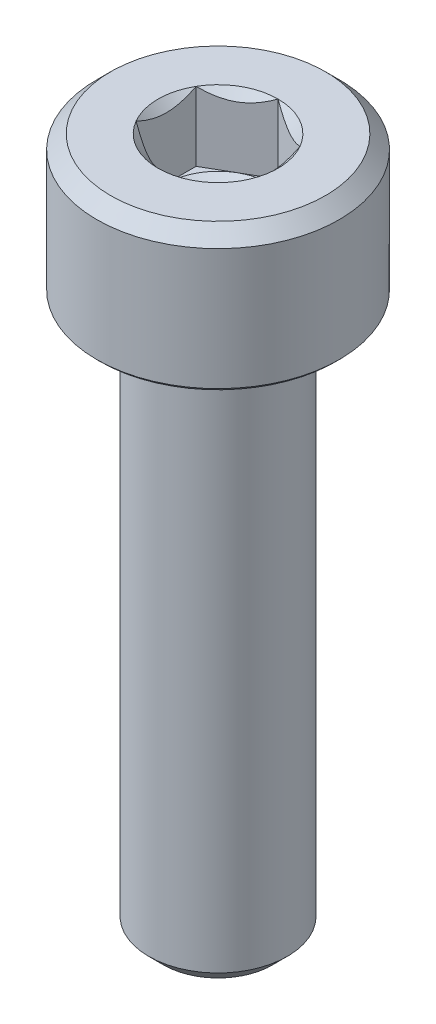
ISO-10303-21;
HEADER;
FILE_DESCRIPTION(('STEP AP214'),'2;1');
FILE_NAME('part.step','',(''),(''),'','','');
FILE_SCHEMA(('AUTOMOTIVE_DESIGN { 1 0 10303 214 1 1 1 1 }'));
ENDSEC;
DATA;
#1=APPLICATION_CONTEXT('core data for automotive mechanical design processes');
#2=APPLICATION_PROTOCOL_DEFINITION('international standard','automotive_design',2000,#1);
#3=PRODUCT_CONTEXT('',#1,'mechanical');
#4=PRODUCT('Part','Part','',(#3));
#5=PRODUCT_RELATED_PRODUCT_CATEGORY('part','',(#4));
#6=PRODUCT_DEFINITION_FORMATION('','',#4);
#7=PRODUCT_DEFINITION_CONTEXT('part definition',#1,'design');
#8=PRODUCT_DEFINITION('design','',#6,#7);
#9=PRODUCT_DEFINITION_SHAPE('','',#8);
#10=(LENGTH_UNIT() NAMED_UNIT(*) SI_UNIT(.MILLI.,.METRE.));
#11=(NAMED_UNIT(*) PLANE_ANGLE_UNIT() SI_UNIT($,.RADIAN.));
#12=(NAMED_UNIT(*) SI_UNIT($,.STERADIAN.) SOLID_ANGLE_UNIT());
#13=UNCERTAINTY_MEASURE_WITH_UNIT(LENGTH_MEASURE(1.E-05),#10,'distance_accuracy_value','');
#14=(GEOMETRIC_REPRESENTATION_CONTEXT(3) GLOBAL_UNCERTAINTY_ASSIGNED_CONTEXT((#13)) GLOBAL_UNIT_ASSIGNED_CONTEXT((#10,
#11,#12)) REPRESENTATION_CONTEXT('',''));
#15=CARTESIAN_POINT('',(0.,0.,0.));
#16=DIRECTION('',(0.,0.,1.));
#17=DIRECTION('',(1.,0.,0.));
#18=AXIS2_PLACEMENT_3D('',#15,#16,#17);
#19=CARTESIAN_POINT('',(0.,4.,0.));
#20=DIRECTION('',(0.,1.,0.));
#21=DIRECTION('',(0.,0.,1.));
#22=AXIS2_PLACEMENT_3D('',#19,#20,#21);
#23=CONICAL_SURFACE('',#22,1.7320508075689,0.785398163397445);
#24=CARTESIAN_POINT('',(0.,4.,0.));
#25=DIRECTION('',(0.,1.,0.));
#26=DIRECTION('',(0.,0.,1.));
#27=AXIS2_PLACEMENT_3D('',#24,#25,#26);
#28=CIRCLE('',#27,1.7320508075689);
#29=CARTESIAN_POINT('',(-1.5,4.,-0.86602540378444));
#30=VERTEX_POINT('',#29);
#31=CARTESIAN_POINT('',(-1.50000000000004,4.,0.866025403784418));
#32=VERTEX_POINT('',#31);
#33=EDGE_CURVE('E247',#30,#32,#28,.T.);
#34=ORIENTED_EDGE('',*,*,#33,.T.);
#35=CARTESIAN_POINT('',(-1.5,5.28153461244855,2.61375153443124));
#36=CARTESIAN_POINT('',(-1.5,5.21450107999365,2.5364332982352));
#37=CARTESIAN_POINT('',(-1.5,5.14785604118913,2.45877114539815));
#38=CARTESIAN_POINT('',(-1.5,5.01561998169386,2.30249235648222));
#39=CARTESIAN_POINT('',(-1.5,4.95002947759351,2.22387528384095));
#40=CARTESIAN_POINT('',(-1.5,4.81875075752572,2.06367101348095));
#41=CARTESIAN_POINT('',(-1.5,4.75309501871379,1.98205709733283));
#42=CARTESIAN_POINT('',(-1.5,4.62377798942187,1.81728959712203));
#43=CARTESIAN_POINT('',(-1.5,4.56011620311967,1.73413640413563));
#44=CARTESIAN_POINT('',(-1.5,4.43545880315624,1.56566898274558));
#45=CARTESIAN_POINT('',(-1.5,4.37446688062461,1.48035200503114));
#46=CARTESIAN_POINT('',(-1.5,4.2564063541614,1.30690812630129));
#47=CARTESIAN_POINT('',(-1.5,4.19934096782129,1.21877900543265));
#48=CARTESIAN_POINT('',(-1.5,4.09158252478268,1.03958624771226));
#49=CARTESIAN_POINT('',(-1.5,4.04084368773945,0.948550507483815));
#50=CARTESIAN_POINT('',(-1.5,3.94844987030331,0.761986921363865));
#51=CARTESIAN_POINT('',(-1.5,3.90677817713367,0.666467741575942));
#52=CARTESIAN_POINT('',(-1.5,3.8542922732506,0.518335423838084));
#53=CARTESIAN_POINT('',(-1.5,3.8383468879137,0.467548943160185));
#54=CARTESIAN_POINT('',(-1.5,3.81087313047549,0.364780075017314));
#55=CARTESIAN_POINT('',(-1.5,3.79934405336009,0.312797879840445));
#56=CARTESIAN_POINT('',(-1.5,3.78146895230353,0.208263726468522));
#57=CARTESIAN_POINT('',(-1.5,3.77509135834624,0.155717269701104));
#58=CARTESIAN_POINT('',(-1.5,3.76786859784852,0.0502421784891453));
#59=CARTESIAN_POINT('',(-1.5,3.76702284990756,-0.00268641520717832));
#60=CARTESIAN_POINT('',(-1.5,3.77093156253543,-0.108400938777915));
#61=CARTESIAN_POINT('',(-1.5,3.77569334257604,-0.161186591847997));
#62=CARTESIAN_POINT('',(-1.5,3.79046885854601,-0.266012188152723));
#63=CARTESIAN_POINT('',(-1.5,3.80048362880619,-0.318051982451445));
#64=CARTESIAN_POINT('',(-1.5,3.82519736738058,-0.421378040345766));
#65=CARTESIAN_POINT('',(-1.5,3.83992908122158,-0.472656332990276));
#66=CARTESIAN_POINT('',(-1.5,3.87328050565471,-0.573912573221064));
#67=CARTESIAN_POINT('',(-1.5,3.89190025941529,-0.623890506362677));
#68=CARTESIAN_POINT('',(-1.5,3.93684584267668,-0.733662552428345));
#69=CARTESIAN_POINT('',(-1.5,3.96396264080806,-0.793130071865139));
#70=CARTESIAN_POINT('',(-1.5,4.02181315098886,-0.910294163138359));
#71=CARTESIAN_POINT('',(-1.5,4.05254895263484,-0.967989687354049));
#72=CARTESIAN_POINT('',(-1.5,4.11682626837555,-1.08192590330593));
#73=CARTESIAN_POINT('',(-1.5,4.15037292738328,-1.13816366920393));
#74=CARTESIAN_POINT('',(-1.5,4.21959355392663,-1.24931997810833));
#75=CARTESIAN_POINT('',(-1.5,4.25526794513362,-1.30423825530527));
#76=CARTESIAN_POINT('',(-1.5,4.36511423645762,-1.46789283632466));
#77=CARTESIAN_POINT('',(-1.5,4.44177274150289,-1.57495566964923));
#78=CARTESIAN_POINT('',(-1.5,4.59911814527717,-1.78584148920914));
#79=CARTESIAN_POINT('',(-1.5,4.67980054314415,-1.88966789317006));
#80=CARTESIAN_POINT('',(-1.5,4.84659527703811,-2.09844803265251));
#81=CARTESIAN_POINT('',(-1.5,4.93279886899882,-2.20332862589446));
#82=CARTESIAN_POINT('',(-1.5,5.06315440470001,-2.35880243066718));
#83=CARTESIAN_POINT('',(-1.5,5.10654041452752,-2.4100430081702));
#84=CARTESIAN_POINT('',(-1.5,5.19373642702162,-2.51215761680078));
#85=CARTESIAN_POINT('',(-1.5,5.23754640718608,-2.56303166713437));
#86=CARTESIAN_POINT('',(-1.5,5.2815346124484,-2.61375153443136));
#87=B_SPLINE_CURVE_WITH_KNOTS('',3,(#35,#36,#37,#38,#39,#40,#41,#42,#43,#44,#45,#46,#47,#48,#49,
#50,#51,#52,#53,#54,#55,#56,#57,#58,#59,#60,#61,#62,#63,#64,#65,#66,#67,#68,#69,#70,#71,#72,#73,
#74,#75,#76,#77,#78,#79,#80,#81,#82,#83,#84,#85,#86),.UNSPECIFIED.,.F.,.F.,(4,2,2,2,2,2,2,2,2,2,
2,2,2,2,2,2,2,2,2,2,2,2,2,2,2,4),(0.,0.306999294556212,0.614144659678539,0.928357224148121,
1.24249102505777,1.55704622448395,1.8718561891122,2.18423656804922,2.49603618850473,
2.65556931703017,2.81507696725606,2.97359952250406,3.13210541666291,3.290818437129,
3.44956272044174,3.60943382831675,3.76930671131586,3.96521523790353,4.1612374410813,
4.35762662181826,4.55405503872929,4.94890209364074,5.34331699281754,5.7505583659593,
5.95198061901673,6.15339223963107),.UNSPECIFIED.);
#88=EDGE_CURVE('E134',#32,#30,#87,.T.);
#89=ORIENTED_EDGE('',*,*,#88,.T.);
#90=EDGE_LOOP('',(#34,#89));
#91=FACE_BOUND('',#90,.T.);
#92=ADVANCED_FACE('F42',(#91),#23,.F.);
#93=CARTESIAN_POINT('',(0.,4.,-1.7320508075689));
#94=VERTEX_POINT('',#93);
#95=EDGE_CURVE('E249',#94,#30,#28,.T.);
#96=ORIENTED_EDGE('',*,*,#95,.T.);
#97=CARTESIAN_POINT('',(-1.5002,4.00011548160005,-0.865909933730602));
#98=CARTESIAN_POINT('',(-1.44863220926293,3.97036547606731,-0.895682611594167));
#99=CARTESIAN_POINT('',(-1.3962020823348,3.94236248391029,-0.925953159489766));
#100=CARTESIAN_POINT('',(-1.28929096594441,3.89108923044012,-0.987678321317124));
#101=CARTESIAN_POINT('',(-1.23479980418535,3.86784750504436,-1.01913880822718));
#102=CARTESIAN_POINT('',(-1.12492091864276,3.8280337289922,-1.08257741237344));
#103=CARTESIAN_POINT('',(-1.06956119090481,3.81136158567088,-1.11453936608521));
#104=CARTESIAN_POINT('',(-0.957622742522867,3.78567445681809,-1.1791670593912));
#105=CARTESIAN_POINT('',(-0.90104744344701,3.77664029047885,-1.21183082354213));
#106=CARTESIAN_POINT('',(-0.803544610483581,3.76848908122684,-1.26812411040032));
#107=CARTESIAN_POINT('',(-0.762743091719556,3.7672822529892,-1.29168087824208));
#108=CARTESIAN_POINT('',(-0.681212030384165,3.76931405716225,-1.33875285845138));
#109=CARTESIAN_POINT('',(-0.640482505685394,3.77255367074829,-1.36226806050018));
#110=CARTESIAN_POINT('',(-0.559415597836609,3.78329198598195,-1.40907206156905));
#111=CARTESIAN_POINT('',(-0.519078615401738,3.79079465301872,-1.43236062923612));
#112=CARTESIAN_POINT('',(-0.439081663085996,3.80965161192827,-1.47854689118997));
#113=CARTESIAN_POINT('',(-0.399421991483819,3.82100755701857,-1.50144441326545));
#114=CARTESIAN_POINT('',(-0.297836865225538,3.85472164759266,-1.56009461325634));
#115=CARTESIAN_POINT('',(-0.236541446290329,3.87962184909335,-1.59548353987867));
#116=CARTESIAN_POINT('',(-0.146414371536698,3.92165665327157,-1.64751843074896));
#117=CARTESIAN_POINT('',(-0.116714860092291,3.93642515355909,-1.66466545167618));
#118=CARTESIAN_POINT('',(-0.0578620986162534,3.96731056594017,-1.69864410935693));
#119=CARTESIAN_POINT('',(-0.0287085957793651,3.98342683412171,-1.71547589206763));
#120=CARTESIAN_POINT('',(0.000199999999999694,4.00011548160007,-1.73216627762274));
#121=B_SPLINE_CURVE_WITH_KNOTS('',3,(#97,#98,#99,#100,#101,#102,#103,#104,#105,#106,#107,#108,
#109,#110,#111,#112,#113,#114,#115,#116,#117,#118,#119,#120),.UNSPECIFIED.,.F.,.F.,(4,2,2,2,2,2,
2,2,2,2,2,4),(0.,0.199829143693299,0.400822987382378,0.598623720538165,0.795926240188868,
0.937113067959859,1.0783310557719,1.21968061668219,1.36109089931052,1.58570969637565,
1.69770705470964,1.80965120737195),.UNSPECIFIED.);
#122=EDGE_CURVE('E209',#30,#94,#121,.T.);
#123=ORIENTED_EDGE('',*,*,#122,.T.);
#124=EDGE_LOOP('',(#96,#123));
#125=FACE_BOUND('',#124,.T.);
#126=ADVANCED_FACE('F293',(#125),#23,.F.);
#127=CARTESIAN_POINT('',(1.5,4.,-0.86602540378444));
#128=VERTEX_POINT('',#127);
#129=EDGE_CURVE('E246',#128,#94,#28,.T.);
#130=ORIENTED_EDGE('',*,*,#129,.T.);
#131=CARTESIAN_POINT('',(-0.0002,4.00011548160007,-1.73216627762274));
#132=CARTESIAN_POINT('',(0.0513677907370763,3.97036547606733,-1.70239359975917));
#133=CARTESIAN_POINT('',(0.103797917665202,3.94236248391031,-1.67212305186357));
#134=CARTESIAN_POINT('',(0.210709034055599,3.89108923044014,-1.61039789003621));
#135=CARTESIAN_POINT('',(0.265200195814664,3.86784750504437,-1.57893740312616));
#136=CARTESIAN_POINT('',(0.375079081357254,3.82803372899221,-1.51549879897989));
#137=CARTESIAN_POINT('',(0.430438809095206,3.81136158567089,-1.48353684526812));
#138=CARTESIAN_POINT('',(0.542377257477159,3.78567445681809,-1.41890915196212));
#139=CARTESIAN_POINT('',(0.598952556553018,3.77664029047885,-1.38624538781119));
#140=CARTESIAN_POINT('',(0.696455389516451,3.76848908122684,-1.329952100953));
#141=CARTESIAN_POINT('',(0.737256908280475,3.7672822529892,-1.30639533311125));
#142=CARTESIAN_POINT('',(0.818787969615867,3.76931405716225,-1.25932335290194));
#143=CARTESIAN_POINT('',(0.859517494314638,3.77255367074829,-1.23580815085314));
#144=CARTESIAN_POINT('',(0.940584402163423,3.78329198598195,-1.18900414978427));
#145=CARTESIAN_POINT('',(0.980921384598295,3.79079465301872,-1.1657155821172));
#146=CARTESIAN_POINT('',(1.06091833691404,3.80965161192827,-1.11952932016336));
#147=CARTESIAN_POINT('',(1.10057800851621,3.82100755701857,-1.09663179808787));
#148=CARTESIAN_POINT('',(1.20216313477449,3.85472164759265,-1.03798159809699));
#149=CARTESIAN_POINT('',(1.26345855370969,3.87962184909335,-1.00259267147466));
#150=CARTESIAN_POINT('',(1.35358562846331,3.92165665327156,-0.950557780604377));
#151=CARTESIAN_POINT('',(1.38328513990772,3.93642515355908,-0.93341075967715));
#152=CARTESIAN_POINT('',(1.44213790138375,3.96731056594015,-0.899432101996409));
#153=CARTESIAN_POINT('',(1.47129140422064,3.98342683412169,-0.882600319285712));
#154=CARTESIAN_POINT('',(1.5002,4.00011548160005,-0.865909933730602));
#155=B_SPLINE_CURVE_WITH_KNOTS('',3,(#131,#132,#133,#134,#135,#136,#137,#138,#139,#140,#141,
#142,#143,#144,#145,#146,#147,#148,#149,#150,#151,#152,#153,#154),.UNSPECIFIED.,.F.,.F.,(4,2,2,
2,2,2,2,2,2,2,2,4),(0.,0.19982914369331,0.400822987382399,0.598623720538196,0.795926240188909,
0.9371130679599,1.07833105577195,1.21968061668224,1.36109089931056,1.58570969637567,
1.69770705470965,1.80965120737195),.UNSPECIFIED.);
#156=EDGE_CURVE('E260',#94,#128,#155,.T.);
#157=ORIENTED_EDGE('',*,*,#156,.T.);
#158=EDGE_LOOP('',(#130,#157));
#159=FACE_BOUND('',#158,.T.);
#160=ADVANCED_FACE('F258',(#159),#23,.F.);
#161=CARTESIAN_POINT('',(1.5,4.,0.86602540378444));
#162=VERTEX_POINT('',#161);
#163=EDGE_CURVE('E241',#162,#128,#28,.T.);
#164=ORIENTED_EDGE('',*,*,#163,.T.);
#165=CARTESIAN_POINT('',(1.5,5.28153461244855,-2.61375153443124));
#166=CARTESIAN_POINT('',(1.5,5.21450107999365,-2.5364332982352));
#167=CARTESIAN_POINT('',(1.5,5.14785604118913,-2.45877114539815));
#168=CARTESIAN_POINT('',(1.5,5.01561998169386,-2.30249235648222));
#169=CARTESIAN_POINT('',(1.5,4.95002947759351,-2.22387528384095));
#170=CARTESIAN_POINT('',(1.5,4.81875075752572,-2.06367101348095));
#171=CARTESIAN_POINT('',(1.5,4.75309501871379,-1.98205709733283));
#172=CARTESIAN_POINT('',(1.5,4.62377798942187,-1.81728959712203));
#173=CARTESIAN_POINT('',(1.5,4.56011620311967,-1.73413640413563));
#174=CARTESIAN_POINT('',(1.5,4.43545880315624,-1.56566898274558));
#175=CARTESIAN_POINT('',(1.5,4.37446688062461,-1.48035200503114));
#176=CARTESIAN_POINT('',(1.5,4.2564063541614,-1.30690812630129));
#177=CARTESIAN_POINT('',(1.5,4.19934096782129,-1.21877900543265));
#178=CARTESIAN_POINT('',(1.5,4.09158252478268,-1.03958624771226));
#179=CARTESIAN_POINT('',(1.5,4.04084368773945,-0.948550507483815));
#180=CARTESIAN_POINT('',(1.5,3.94844987030331,-0.761986921363865));
#181=CARTESIAN_POINT('',(1.5,3.90677817713367,-0.666467741575942));
#182=CARTESIAN_POINT('',(1.5,3.8542922732506,-0.518335423838084));
#183=CARTESIAN_POINT('',(1.5,3.8383468879137,-0.467548943160185));
#184=CARTESIAN_POINT('',(1.5,3.81087313047549,-0.364780075017314));
#185=CARTESIAN_POINT('',(1.5,3.79934405336009,-0.312797879840445));
#186=CARTESIAN_POINT('',(1.5,3.78146895230353,-0.208263726468522));
#187=CARTESIAN_POINT('',(1.5,3.77509135834624,-0.155717269701104));
#188=CARTESIAN_POINT('',(1.5,3.76786859784852,-0.0502421784891453));
#189=CARTESIAN_POINT('',(1.5,3.76702284990756,0.00268641520717832));
#190=CARTESIAN_POINT('',(1.5,3.77093156253543,0.108400938777915));
#191=CARTESIAN_POINT('',(1.5,3.77569334257604,0.161186591847997));
#192=CARTESIAN_POINT('',(1.5,3.79046885854601,0.266012188152723));
#193=CARTESIAN_POINT('',(1.5,3.80048362880619,0.318051982451445));
#194=CARTESIAN_POINT('',(1.5,3.82519736738058,0.421378040345766));
#195=CARTESIAN_POINT('',(1.5,3.83992908122158,0.472656332990276));
#196=CARTESIAN_POINT('',(1.5,3.87328050565471,0.573912573221064));
#197=CARTESIAN_POINT('',(1.5,3.89190025941529,0.623890506362677));
#198=CARTESIAN_POINT('',(1.5,3.93684584267668,0.733662552428345));
#199=CARTESIAN_POINT('',(1.5,3.96396264080806,0.793130071865139));
#200=CARTESIAN_POINT('',(1.5,4.02181315098886,0.910294163138359));
#201=CARTESIAN_POINT('',(1.5,4.05254895263484,0.967989687354049));
#202=CARTESIAN_POINT('',(1.5,4.11682626837555,1.08192590330593));
#203=CARTESIAN_POINT('',(1.5,4.15037292738328,1.13816366920393));
#204=CARTESIAN_POINT('',(1.5,4.21959355392663,1.24931997810833));
#205=CARTESIAN_POINT('',(1.5,4.25526794513362,1.30423825530527));
#206=CARTESIAN_POINT('',(1.5,4.36511423645762,1.46789283632466));
#207=CARTESIAN_POINT('',(1.5,4.44177274150289,1.57495566964923));
#208=CARTESIAN_POINT('',(1.5,4.59911814527717,1.78584148920914));
#209=CARTESIAN_POINT('',(1.5,4.67980054314415,1.88966789317006));
#210=CARTESIAN_POINT('',(1.5,4.84659527703811,2.09844803265251));
#211=CARTESIAN_POINT('',(1.5,4.93279886899882,2.20332862589446));
#212=CARTESIAN_POINT('',(1.5,5.06315440470001,2.35880243066718));
#213=CARTESIAN_POINT('',(1.5,5.10654041452752,2.4100430081702));
#214=CARTESIAN_POINT('',(1.5,5.19373642702162,2.51215761680078));
#215=CARTESIAN_POINT('',(1.5,5.23754640718608,2.56303166713437));
#216=CARTESIAN_POINT('',(1.5,5.2815346124484,2.61375153443136));
#217=B_SPLINE_CURVE_WITH_KNOTS('',3,(#165,#166,#167,#168,#169,#170,#171,#172,#173,#174,#175,
#176,#177,#178,#179,#180,#181,#182,#183,#184,#185,#186,#187,#188,#189,#190,#191,#192,#193,#194,
#195,#196,#197,#198,#199,#200,#201,#202,#203,#204,#205,#206,#207,#208,#209,#210,#211,#212,#213,
#214,#215,#216),.UNSPECIFIED.,.F.,.F.,(4,2,2,2,2,2,2,2,2,2,2,2,2,2,2,2,2,2,2,2,2,2,2,2,2,4),(0.,
0.306999294556212,0.614144659678539,0.928357224148121,1.24249102505777,1.55704622448395,
1.8718561891122,2.18423656804922,2.49603618850473,2.65556931703017,2.81507696725606,
2.97359952250406,3.13210541666291,3.290818437129,3.44956272044174,3.60943382831675,
3.76930671131586,3.96521523790353,4.1612374410813,4.35762662181826,4.55405503872929,
4.94890209364074,5.34331699281754,5.7505583659593,5.95198061901673,6.15339223963107),.UNSPECIFIED.);
#218=EDGE_CURVE('E268',#128,#162,#217,.T.);
#219=ORIENTED_EDGE('',*,*,#218,.T.);
#220=EDGE_LOOP('',(#164,#219));
#221=FACE_BOUND('',#220,.T.);
#222=ADVANCED_FACE('F267',(#221),#23,.F.);
#223=CARTESIAN_POINT('',(0.,4.,1.7320508075689));
#224=VERTEX_POINT('',#223);
#225=EDGE_CURVE('E239',#224,#162,#28,.T.);
#226=ORIENTED_EDGE('',*,*,#225,.T.);
#227=CARTESIAN_POINT('',(1.5002,4.00011548160005,0.865909933730602));
#228=CARTESIAN_POINT('',(1.44863220926293,3.97036547606731,0.895682611594167));
#229=CARTESIAN_POINT('',(1.3962020823348,3.94236248391029,0.925953159489766));
#230=CARTESIAN_POINT('',(1.28929096594441,3.89108923044012,0.987678321317124));
#231=CARTESIAN_POINT('',(1.23479980418535,3.86784750504436,1.01913880822718));
#232=CARTESIAN_POINT('',(1.12492091864276,3.8280337289922,1.08257741237344));
#233=CARTESIAN_POINT('',(1.06956119090481,3.81136158567088,1.11453936608521));
#234=CARTESIAN_POINT('',(0.957622742522867,3.78567445681809,1.1791670593912));
#235=CARTESIAN_POINT('',(0.90104744344701,3.77664029047885,1.21183082354213));
#236=CARTESIAN_POINT('',(0.803544610483581,3.76848908122684,1.26812411040032));
#237=CARTESIAN_POINT('',(0.762743091719556,3.7672822529892,1.29168087824208));
#238=CARTESIAN_POINT('',(0.681212030384165,3.76931405716225,1.33875285845138));
#239=CARTESIAN_POINT('',(0.640482505685394,3.77255367074829,1.36226806050018));
#240=CARTESIAN_POINT('',(0.559415597836609,3.78329198598195,1.40907206156905));
#241=CARTESIAN_POINT('',(0.519078615401738,3.79079465301872,1.43236062923612));
#242=CARTESIAN_POINT('',(0.439081663085996,3.80965161192827,1.47854689118997));
#243=CARTESIAN_POINT('',(0.399421991483819,3.82100755701857,1.50144441326545));
#244=CARTESIAN_POINT('',(0.297836865225538,3.85472164759266,1.56009461325634));
#245=CARTESIAN_POINT('',(0.236541446290329,3.87962184909335,1.59548353987867));
#246=CARTESIAN_POINT('',(0.146414371536698,3.92165665327157,1.64751843074896));
#247=CARTESIAN_POINT('',(0.116714860092291,3.93642515355909,1.66466545167618));
#248=CARTESIAN_POINT('',(0.0578620986162534,3.96731056594017,1.69864410935693));
#249=CARTESIAN_POINT('',(0.0287085957793651,3.98342683412171,1.71547589206763));
#250=CARTESIAN_POINT('',(-0.000199999999999694,4.00011548160007,1.73216627762274));
#251=B_SPLINE_CURVE_WITH_KNOTS('',3,(#227,#228,#229,#230,#231,#232,#233,#234,#235,#236,#237,
#238,#239,#240,#241,#242,#243,#244,#245,#246,#247,#248,#249,#250),.UNSPECIFIED.,.F.,.F.,(4,2,2,
2,2,2,2,2,2,2,2,4),(0.,0.199829143693299,0.400822987382378,0.598623720538165,0.795926240188868,
0.937113067959859,1.0783310557719,1.21968061668219,1.36109089931052,1.58570969637565,
1.69770705470964,1.80965120737195),.UNSPECIFIED.);
#252=EDGE_CURVE('E178',#162,#224,#251,.T.);
#253=ORIENTED_EDGE('',*,*,#252,.T.);
#254=EDGE_LOOP('',(#226,#253));
#255=FACE_BOUND('',#254,.T.);
#256=ADVANCED_FACE('F298',(#255),#23,.F.);
#257=EDGE_CURVE('E238',#32,#224,#28,.T.);
#258=ORIENTED_EDGE('',*,*,#257,.T.);
#259=CARTESIAN_POINT('',(0.0002,4.00011548160007,1.73216627762274));
#260=CARTESIAN_POINT('',(-0.0513677907370763,3.97036547606733,1.70239359975917));
#261=CARTESIAN_POINT('',(-0.103797917665202,3.94236248391031,1.67212305186357));
#262=CARTESIAN_POINT('',(-0.210709034055599,3.89108923044014,1.61039789003621));
#263=CARTESIAN_POINT('',(-0.265200195814664,3.86784750504437,1.57893740312616));
#264=CARTESIAN_POINT('',(-0.375079081357254,3.82803372899221,1.51549879897989));
#265=CARTESIAN_POINT('',(-0.430438809095206,3.81136158567089,1.48353684526812));
#266=CARTESIAN_POINT('',(-0.542377257477159,3.78567445681809,1.41890915196212));
#267=CARTESIAN_POINT('',(-0.598952556553018,3.77664029047885,1.38624538781119));
#268=CARTESIAN_POINT('',(-0.696455389516451,3.76848908122684,1.329952100953));
#269=CARTESIAN_POINT('',(-0.737256908280475,3.7672822529892,1.30639533311125));
#270=CARTESIAN_POINT('',(-0.818787969615867,3.76931405716225,1.25932335290194));
#271=CARTESIAN_POINT('',(-0.859517494314638,3.77255367074829,1.23580815085314));
#272=CARTESIAN_POINT('',(-0.940584402163423,3.78329198598195,1.18900414978427));
#273=CARTESIAN_POINT('',(-0.980921384598295,3.79079465301872,1.1657155821172));
#274=CARTESIAN_POINT('',(-1.06091833691404,3.80965161192827,1.11952932016336));
#275=CARTESIAN_POINT('',(-1.10057800851621,3.82100755701857,1.09663179808787));
#276=CARTESIAN_POINT('',(-1.20216313477449,3.85472164759265,1.03798159809699));
#277=CARTESIAN_POINT('',(-1.26345855370969,3.87962184909335,1.00259267147466));
#278=CARTESIAN_POINT('',(-1.35358562846331,3.92165665327156,0.950557780604377));
#279=CARTESIAN_POINT('',(-1.38328513990772,3.93642515355908,0.93341075967715));
#280=CARTESIAN_POINT('',(-1.44213790138375,3.96731056594015,0.899432101996409));
#281=CARTESIAN_POINT('',(-1.47129140422064,3.98342683412169,0.882600319285712));
#282=CARTESIAN_POINT('',(-1.5002,4.00011548160005,0.865909933730602));
#283=B_SPLINE_CURVE_WITH_KNOTS('',3,(#259,#260,#261,#262,#263,#264,#265,#266,#267,#268,#269,
#270,#271,#272,#273,#274,#275,#276,#277,#278,#279,#280,#281,#282),.UNSPECIFIED.,.F.,.F.,(4,2,2,
2,2,2,2,2,2,2,2,4),(0.,0.19982914369331,0.400822987382399,0.598623720538196,0.795926240188909,
0.9371130679599,1.07833105577195,1.21968061668224,1.36109089931056,1.58570969637567,
1.69770705470965,1.80965120737195),.UNSPECIFIED.);
#284=EDGE_CURVE('E65',#224,#32,#283,.T.);
#285=ORIENTED_EDGE('',*,*,#284,.T.);
#286=EDGE_LOOP('',(#258,#285));
#287=FACE_BOUND('',#286,.T.);
#288=ADVANCED_FACE('F185',(#287),#23,.F.);
#289=CARTESIAN_POINT('',(1.7320508075689,4.,0.));
#290=DIRECTION('',(0.,-1.,0.));
#291=DIRECTION('',(0.,0.,-1.));
#292=AXIS2_PLACEMENT_3D('',#289,#290,#291);
#293=PLANE('',#292);
#294=ORIENTED_EDGE('',*,*,#225,.F.);
#295=ORIENTED_EDGE('',*,*,#257,.F.);
#296=ORIENTED_EDGE('',*,*,#33,.F.);
#297=ORIENTED_EDGE('',*,*,#95,.F.);
#298=ORIENTED_EDGE('',*,*,#129,.F.);
#299=ORIENTED_EDGE('',*,*,#163,.F.);
#300=EDGE_LOOP('',(#294,#295,#296,#297,#298,#299));
#301=FACE_BOUND('',#300,.T.);
#302=CARTESIAN_POINT('',(0.,4.,0.));
#303=DIRECTION('',(0.,1.,0.));
#304=DIRECTION('',(0.,0.,1.));
#305=AXIS2_PLACEMENT_3D('',#302,#303,#304);
#306=CIRCLE('',#305,3.1);
#307=CARTESIAN_POINT('',(0.,4.,3.1));
#308=VERTEX_POINT('',#307);
#309=EDGE_CURVE('E236',#308,#308,#306,.T.);
#310=ORIENTED_EDGE('',*,*,#309,.T.);
#311=EDGE_LOOP('',(#310));
#312=FACE_BOUND('',#311,.T.);
#313=ADVANCED_FACE('F264',(#301,#312),#293,.F.);
#314=CARTESIAN_POINT('',(0.,3.6,0.));
#315=DIRECTION('',(0.,-1.,0.));
#316=DIRECTION('',(0.,0.,-1.));
#317=AXIS2_PLACEMENT_3D('',#314,#315,#316);
#318=CONICAL_SURFACE('',#317,3.5,0.785398163397447);
#319=ORIENTED_EDGE('',*,*,#309,.F.);
#320=EDGE_LOOP('',(#319));
#321=FACE_BOUND('',#320,.T.);
#322=CARTESIAN_POINT('',(0.,3.6,0.));
#323=DIRECTION('',(0.,1.,0.));
#324=DIRECTION('',(0.,0.,1.));
#325=AXIS2_PLACEMENT_3D('',#322,#323,#324);
#326=CIRCLE('',#325,3.5);
#327=CARTESIAN_POINT('',(0.,3.6,3.5));
#328=VERTEX_POINT('',#327);
#329=EDGE_CURVE('E233',#328,#328,#326,.T.);
#330=ORIENTED_EDGE('',*,*,#329,.T.);
#331=EDGE_LOOP('',(#330));
#332=FACE_BOUND('',#331,.T.);
#333=ADVANCED_FACE('F303',(#321,#332),#318,.T.);
#334=CARTESIAN_POINT('',(0.,-16.,0.));
#335=DIRECTION('',(0.,1.,0.));
#336=DIRECTION('',(0.,0.,1.));
#337=AXIS2_PLACEMENT_3D('',#334,#335,#336);
#338=CYLINDRICAL_SURFACE('',#337,3.5);
#339=ORIENTED_EDGE('',*,*,#329,.F.);
#340=EDGE_LOOP('',(#339));
#341=FACE_BOUND('',#340,.T.);
#342=CARTESIAN_POINT('',(0.,0.0999999999999994,0.));
#343=DIRECTION('',(0.,1.,0.));
#344=DIRECTION('',(0.,0.,1.));
#345=AXIS2_PLACEMENT_3D('',#342,#343,#344);
#346=CIRCLE('',#345,3.5);
#347=CARTESIAN_POINT('',(0.,0.0999999999999994,3.5));
#348=VERTEX_POINT('',#347);
#349=EDGE_CURVE('E230',#348,#348,#346,.T.);
#350=ORIENTED_EDGE('',*,*,#349,.T.);
#351=EDGE_LOOP('',(#350));
#352=FACE_BOUND('',#351,.T.);
#353=ADVANCED_FACE('F381',(#341,#352),#338,.T.);
#354=CARTESIAN_POINT('',(0.,0.,0.));
#355=DIRECTION('',(0.,1.,0.));
#356=DIRECTION('',(0.,0.,1.));
#357=AXIS2_PLACEMENT_3D('',#354,#355,#356);
#358=CONICAL_SURFACE('',#357,3.4,0.785398163397453);
#359=ORIENTED_EDGE('',*,*,#349,.F.);
#360=EDGE_LOOP('',(#359));
#361=FACE_BOUND('',#360,.T.);
#362=CARTESIAN_POINT('',(0.,0.,0.));
#363=DIRECTION('',(0.,1.,0.));
#364=DIRECTION('',(0.,0.,1.));
#365=AXIS2_PLACEMENT_3D('',#362,#363,#364);
#366=CIRCLE('',#365,3.4);
#367=CARTESIAN_POINT('',(0.,0.,3.4));
#368=VERTEX_POINT('',#367);
#369=EDGE_CURVE('E227',#368,#368,#366,.T.);
#370=ORIENTED_EDGE('',*,*,#369,.T.);
#371=EDGE_LOOP('',(#370));
#372=FACE_BOUND('',#371,.T.);
#373=ADVANCED_FACE('F385',(#361,#372),#358,.T.);
#374=CARTESIAN_POINT('',(3.4,0.,0.));
#375=DIRECTION('',(0.,1.,0.));
#376=DIRECTION('',(0.,0.,1.));
#377=AXIS2_PLACEMENT_3D('',#374,#375,#376);
#378=PLANE('',#377);
#379=ORIENTED_EDGE('',*,*,#369,.F.);
#380=EDGE_LOOP('',(#379));
#381=FACE_BOUND('',#380,.T.);
#382=CARTESIAN_POINT('',(0.,0.,0.));
#383=DIRECTION('',(0.,1.,0.));
#384=DIRECTION('',(0.,0.,1.));
#385=AXIS2_PLACEMENT_3D('',#382,#383,#384);
#386=CIRCLE('',#385,2.05);
#387=CARTESIAN_POINT('',(0.,0.,2.05));
#388=VERTEX_POINT('',#387);
#389=EDGE_CURVE('E224',#388,#388,#386,.T.);
#390=ORIENTED_EDGE('',*,*,#389,.T.);
#391=EDGE_LOOP('',(#390));
#392=FACE_BOUND('',#391,.T.);
#393=ADVANCED_FACE('F442',(#381,#392),#378,.F.);
#394=CARTESIAN_POINT('',(0.,-0.6,0.));
#395=DIRECTION('',(0.,1.,0.));
#396=DIRECTION('',(0.,0.,1.));
#397=AXIS2_PLACEMENT_3D('',#394,#395,#396);
#398=CONICAL_SURFACE('',#397,2.,0.0831412318884407);
#399=ORIENTED_EDGE('',*,*,#389,.F.);
#400=EDGE_LOOP('',(#399));
#401=FACE_BOUND('',#400,.T.);
#402=CARTESIAN_POINT('',(0.,-0.6,0.));
#403=DIRECTION('',(0.,1.,0.));
#404=DIRECTION('',(0.,0.,1.));
#405=AXIS2_PLACEMENT_3D('',#402,#403,#404);
#406=CIRCLE('',#405,2.);
#407=CARTESIAN_POINT('',(0.,-0.6,2.));
#408=VERTEX_POINT('',#407);
#409=EDGE_CURVE('E221',#408,#408,#406,.T.);
#410=ORIENTED_EDGE('',*,*,#409,.T.);
#411=EDGE_LOOP('',(#410));
#412=FACE_BOUND('',#411,.T.);
#413=ADVANCED_FACE('F431',(#401,#412),#398,.T.);
#414=CARTESIAN_POINT('',(0.,-16.,0.));
#415=DIRECTION('',(0.,1.,0.));
#416=DIRECTION('',(0.,0.,1.));
#417=AXIS2_PLACEMENT_3D('',#414,#415,#416);
#418=CYLINDRICAL_SURFACE('',#417,2.);
#419=ORIENTED_EDGE('',*,*,#409,.F.);
#420=EDGE_LOOP('',(#419));
#421=FACE_BOUND('',#420,.T.);
#422=CARTESIAN_POINT('',(0.,-15.5705,0.));
#423=DIRECTION('',(0.,1.,0.));
#424=DIRECTION('',(0.,0.,1.));
#425=AXIS2_PLACEMENT_3D('',#422,#423,#424);
#426=CIRCLE('',#425,2.);
#427=CARTESIAN_POINT('',(0.,-15.5705,2.));
#428=VERTEX_POINT('',#427);
#429=EDGE_CURVE('E218',#428,#428,#426,.T.);
#430=ORIENTED_EDGE('',*,*,#429,.T.);
#431=EDGE_LOOP('',(#430));
#432=FACE_BOUND('',#431,.T.);
#433=ADVANCED_FACE('F324',(#421,#432),#418,.T.);
#434=CARTESIAN_POINT('',(0.,-16.,0.));
#435=DIRECTION('',(0.,1.,0.));
#436=DIRECTION('',(0.,0.,1.));
#437=AXIS2_PLACEMENT_3D('',#434,#435,#436);
#438=CONICAL_SURFACE('',#437,1.5705,0.785398163397447);
#439=ORIENTED_EDGE('',*,*,#429,.F.);
#440=EDGE_LOOP('',(#439));
#441=FACE_BOUND('',#440,.T.);
#442=CARTESIAN_POINT('',(0.,-16.,0.));
#443=DIRECTION('',(0.,1.,0.));
#444=DIRECTION('',(0.,0.,1.));
#445=AXIS2_PLACEMENT_3D('',#442,#443,#444);
#446=CIRCLE('',#445,1.5705);
#447=CARTESIAN_POINT('',(0.,-16.,1.5705));
#448=VERTEX_POINT('',#447);
#449=EDGE_CURVE('E208',#448,#448,#446,.T.);
#450=ORIENTED_EDGE('',*,*,#449,.T.);
#451=EDGE_LOOP('',(#450));
#452=FACE_BOUND('',#451,.T.);
#453=ADVANCED_FACE('F407',(#441,#452),#438,.T.);
#454=CARTESIAN_POINT('',(1.5705,-16.,0.));
#455=DIRECTION('',(0.,1.,0.));
#456=DIRECTION('',(0.,0.,1.));
#457=AXIS2_PLACEMENT_3D('',#454,#455,#456);
#458=PLANE('',#457);
#459=ORIENTED_EDGE('',*,*,#449,.F.);
#460=EDGE_LOOP('',(#459));
#461=FACE_BOUND('',#460,.T.);
#462=ADVANCED_FACE('F199',(#461),#458,.F.);
#463=CARTESIAN_POINT('',(0.,2.,0.));
#464=DIRECTION('',(0.,1.,0.));
#465=DIRECTION('',(0.,0.,1.));
#466=AXIS2_PLACEMENT_3D('',#463,#464,#465);
#467=PLANE('',#466);
#468=CARTESIAN_POINT('',(0.,2.,0.));
#469=DIRECTION('',(0.,1.,0.));
#470=DIRECTION('',(0.,0.,1.));
#471=AXIS2_PLACEMENT_3D('',#468,#469,#470);
#472=CIRCLE('',#471,1.5);
#473=CARTESIAN_POINT('',(-1.5,2.,0.));
#474=VERTEX_POINT('',#473);
#475=CARTESIAN_POINT('',(-0.750000000000019,2.,1.29903810567666));
#476=VERTEX_POINT('',#475);
#477=EDGE_CURVE('E124',#474,#476,#472,.T.);
#478=ORIENTED_EDGE('',*,*,#477,.F.);
#479=DIRECTION('',(0.,0.,1.));
#480=VECTOR('',#479,1.);
#481=CARTESIAN_POINT('',(-1.5,2.,-0.86602540378444));
#482=LINE('',#481,#480);
#483=CARTESIAN_POINT('',(-1.5,2.,0.86602540378444));
#484=VERTEX_POINT('',#483);
#485=EDGE_CURVE('E118',#474,#484,#482,.T.);
#486=ORIENTED_EDGE('',*,*,#485,.T.);
#487=DIRECTION('',(0.866025403784433,0.,0.500000000000009));
#488=VECTOR('',#487,1.);
#489=CARTESIAN_POINT('',(-1.5,2.,0.86602540378444));
#490=LINE('',#489,#488);
#491=EDGE_CURVE('E122',#484,#476,#490,.T.);
#492=ORIENTED_EDGE('',*,*,#491,.T.);
#493=EDGE_LOOP('',(#478,#486,#492));
#494=FACE_BOUND('',#493,.T.);
#495=ADVANCED_FACE('F120',(#494),#467,.T.);
#496=CARTESIAN_POINT('',(-0.750000000000019,2.,-1.29903810567666));
#497=VERTEX_POINT('',#496);
#498=EDGE_CURVE('E532',#497,#474,#472,.T.);
#499=ORIENTED_EDGE('',*,*,#498,.F.);
#500=DIRECTION('',(-0.866025403784433,0.,0.500000000000009));
#501=VECTOR('',#500,1.);
#502=CARTESIAN_POINT('',(0.,2.,-1.7320508075689));
#503=LINE('',#502,#501);
#504=CARTESIAN_POINT('',(-1.5,2.,-0.86602540378444));
#505=VERTEX_POINT('',#504);
#506=EDGE_CURVE('E156',#497,#505,#503,.T.);
#507=ORIENTED_EDGE('',*,*,#506,.T.);
#508=EDGE_CURVE('E128',#505,#474,#482,.T.);
#509=ORIENTED_EDGE('',*,*,#508,.T.);
#510=EDGE_LOOP('',(#499,#507,#509));
#511=FACE_BOUND('',#510,.T.);
#512=ADVANCED_FACE('F291',(#511),#467,.T.);
#513=CARTESIAN_POINT('',(0.750000000000019,2.,-1.29903810567666));
#514=VERTEX_POINT('',#513);
#515=EDGE_CURVE('E531',#514,#497,#472,.T.);
#516=ORIENTED_EDGE('',*,*,#515,.F.);
#517=DIRECTION('',(-0.866025403784433,0.,-0.500000000000009));
#518=VECTOR('',#517,1.);
#519=CARTESIAN_POINT('',(1.5,2.,-0.86602540378444));
#520=LINE('',#519,#518);
#521=CARTESIAN_POINT('',(0.,2.,-1.7320508075689));
#522=VERTEX_POINT('',#521);
#523=EDGE_CURVE('E152',#514,#522,#520,.T.);
#524=ORIENTED_EDGE('',*,*,#523,.T.);
#525=EDGE_CURVE('E138',#522,#497,#503,.T.);
#526=ORIENTED_EDGE('',*,*,#525,.T.);
#527=EDGE_LOOP('',(#516,#524,#526));
#528=FACE_BOUND('',#527,.T.);
#529=ADVANCED_FACE('F476',(#528),#467,.T.);
#530=CARTESIAN_POINT('',(1.5,2.,0.));
#531=VERTEX_POINT('',#530);
#532=EDGE_CURVE('E50',#531,#514,#472,.T.);
#533=ORIENTED_EDGE('',*,*,#532,.F.);
#534=DIRECTION('',(0.,0.,-1.));
#535=VECTOR('',#534,1.);
#536=CARTESIAN_POINT('',(1.5,2.,0.86602540378444));
#537=LINE('',#536,#535);
#538=CARTESIAN_POINT('',(1.5,2.,-0.86602540378444));
#539=VERTEX_POINT('',#538);
#540=EDGE_CURVE('E148',#531,#539,#537,.T.);
#541=ORIENTED_EDGE('',*,*,#540,.T.);
#542=EDGE_CURVE('E153',#539,#514,#520,.T.);
#543=ORIENTED_EDGE('',*,*,#542,.T.);
#544=EDGE_LOOP('',(#533,#541,#543));
#545=FACE_BOUND('',#544,.T.);
#546=ADVANCED_FACE('F289',(#545),#467,.T.);
#547=CARTESIAN_POINT('',(0.750000000000014,2.,1.29903810567665));
#548=VERTEX_POINT('',#547);
#549=EDGE_CURVE('E11',#548,#531,#472,.T.);
#550=ORIENTED_EDGE('',*,*,#549,.F.);
#551=DIRECTION('',(0.866025403784433,0.,-0.500000000000009));
#552=VECTOR('',#551,1.);
#553=CARTESIAN_POINT('',(0.,2.,1.7320508075689));
#554=LINE('',#553,#552);
#555=CARTESIAN_POINT('',(1.5,2.,0.86602540378444));
#556=VERTEX_POINT('',#555);
#557=EDGE_CURVE('E144',#548,#556,#554,.T.);
#558=ORIENTED_EDGE('',*,*,#557,.T.);
#559=EDGE_CURVE('E149',#556,#531,#537,.T.);
#560=ORIENTED_EDGE('',*,*,#559,.T.);
#561=EDGE_LOOP('',(#550,#558,#560));
#562=FACE_BOUND('',#561,.T.);
#563=ADVANCED_FACE('F279',(#562),#467,.T.);
#564=EDGE_CURVE('E51',#476,#548,#472,.T.);
#565=ORIENTED_EDGE('',*,*,#564,.F.);
#566=CARTESIAN_POINT('',(0.,2.,1.7320508075689));
#567=VERTEX_POINT('',#566);
#568=EDGE_CURVE('E143',#476,#567,#490,.T.);
#569=ORIENTED_EDGE('',*,*,#568,.T.);
#570=EDGE_CURVE('E58',#567,#548,#554,.T.);
#571=ORIENTED_EDGE('',*,*,#570,.T.);
#572=EDGE_LOOP('',(#565,#569,#571));
#573=FACE_BOUND('',#572,.T.);
#574=ADVANCED_FACE('F198',(#573),#467,.T.);
#575=CARTESIAN_POINT('',(-1.5,2.,-0.86602540378444));
#576=DIRECTION('',(-1.,0.,0.));
#577=DIRECTION('',(0.,0.,1.));
#578=AXIS2_PLACEMENT_3D('',#575,#576,#577);
#579=PLANE('',#578);
#580=ORIENTED_EDGE('',*,*,#88,.F.);
#581=DIRECTION('',(0.,1.,0.));
#582=VECTOR('',#581,1.);
#583=CARTESIAN_POINT('',(-1.5,2.,0.86602540378444));
#584=LINE('',#583,#582);
#585=EDGE_CURVE('E131',#484,#32,#584,.T.);
#586=ORIENTED_EDGE('',*,*,#585,.F.);
#587=ORIENTED_EDGE('',*,*,#485,.F.);
#588=ORIENTED_EDGE('',*,*,#508,.F.);
#589=DIRECTION('',(0.,1.,0.));
#590=VECTOR('',#589,1.);
#591=CARTESIAN_POINT('',(-1.5,2.,-0.86602540378444));
#592=LINE('',#591,#590);
#593=EDGE_CURVE('E159',#505,#30,#592,.T.);
#594=ORIENTED_EDGE('',*,*,#593,.T.);
#595=EDGE_LOOP('',(#580,#586,#587,#588,#594));
#596=FACE_BOUND('',#595,.T.);
#597=ADVANCED_FACE('F132',(#596),#579,.F.);
#598=CARTESIAN_POINT('',(0.,2.,-1.7320508075689));
#599=DIRECTION('',(-0.500000000000009,0.,-0.866025403784433));
#600=DIRECTION('',(-0.866025403784433,0.,0.500000000000009));
#601=AXIS2_PLACEMENT_3D('',#598,#599,#600);
#602=PLANE('',#601);
#603=ORIENTED_EDGE('',*,*,#122,.F.);
#604=ORIENTED_EDGE('',*,*,#593,.F.);
#605=ORIENTED_EDGE('',*,*,#506,.F.);
#606=ORIENTED_EDGE('',*,*,#525,.F.);
#607=DIRECTION('',(0.,1.,0.));
#608=VECTOR('',#607,1.);
#609=CARTESIAN_POINT('',(0.,2.,-1.7320508075689));
#610=LINE('',#609,#608);
#611=EDGE_CURVE('E161',#522,#94,#610,.T.);
#612=ORIENTED_EDGE('',*,*,#611,.T.);
#613=EDGE_LOOP('',(#603,#604,#605,#606,#612));
#614=FACE_BOUND('',#613,.T.);
#615=ADVANCED_FACE('F197',(#614),#602,.F.);
#616=CARTESIAN_POINT('',(1.5,2.,-0.86602540378444));
#617=DIRECTION('',(0.500000000000009,0.,-0.866025403784433));
#618=DIRECTION('',(-0.866025403784433,0.,-0.500000000000009));
#619=AXIS2_PLACEMENT_3D('',#616,#617,#618);
#620=PLANE('',#619);
#621=ORIENTED_EDGE('',*,*,#156,.F.);
#622=ORIENTED_EDGE('',*,*,#611,.F.);
#623=ORIENTED_EDGE('',*,*,#523,.F.);
#624=ORIENTED_EDGE('',*,*,#542,.F.);
#625=DIRECTION('',(0.,1.,0.));
#626=VECTOR('',#625,1.);
#627=CARTESIAN_POINT('',(1.5,2.,-0.86602540378444));
#628=LINE('',#627,#626);
#629=EDGE_CURVE('E164',#539,#128,#628,.T.);
#630=ORIENTED_EDGE('',*,*,#629,.T.);
#631=EDGE_LOOP('',(#621,#622,#623,#624,#630));
#632=FACE_BOUND('',#631,.T.);
#633=ADVANCED_FACE('F331',(#632),#620,.F.);
#634=CARTESIAN_POINT('',(1.5,2.,0.86602540378444));
#635=DIRECTION('',(1.,0.,0.));
#636=DIRECTION('',(0.,0.,-1.));
#637=AXIS2_PLACEMENT_3D('',#634,#635,#636);
#638=PLANE('',#637);
#639=ORIENTED_EDGE('',*,*,#218,.F.);
#640=ORIENTED_EDGE('',*,*,#629,.F.);
#641=ORIENTED_EDGE('',*,*,#540,.F.);
#642=ORIENTED_EDGE('',*,*,#559,.F.);
#643=DIRECTION('',(0.,1.,0.));
#644=VECTOR('',#643,1.);
#645=CARTESIAN_POINT('',(1.5,2.,0.86602540378444));
#646=LINE('',#645,#644);
#647=EDGE_CURVE('E167',#556,#162,#646,.T.);
#648=ORIENTED_EDGE('',*,*,#647,.T.);
#649=EDGE_LOOP('',(#639,#640,#641,#642,#648));
#650=FACE_BOUND('',#649,.T.);
#651=ADVANCED_FACE('F275',(#650),#638,.F.);
#652=CARTESIAN_POINT('',(0.,2.,1.7320508075689));
#653=DIRECTION('',(0.500000000000009,0.,0.866025403784433));
#654=DIRECTION('',(0.866025403784433,0.,-0.500000000000009));
#655=AXIS2_PLACEMENT_3D('',#652,#653,#654);
#656=PLANE('',#655);
#657=ORIENTED_EDGE('',*,*,#252,.F.);
#658=ORIENTED_EDGE('',*,*,#647,.F.);
#659=ORIENTED_EDGE('',*,*,#557,.F.);
#660=ORIENTED_EDGE('',*,*,#570,.F.);
#661=DIRECTION('',(0.,1.,0.));
#662=VECTOR('',#661,1.);
#663=CARTESIAN_POINT('',(0.,2.,1.7320508075689));
#664=LINE('',#663,#662);
#665=EDGE_CURVE('E137',#567,#224,#664,.T.);
#666=ORIENTED_EDGE('',*,*,#665,.T.);
#667=EDGE_LOOP('',(#657,#658,#659,#660,#666));
#668=FACE_BOUND('',#667,.T.);
#669=ADVANCED_FACE('F191',(#668),#656,.F.);
#670=CARTESIAN_POINT('',(-1.5,2.,0.86602540378444));
#671=DIRECTION('',(-0.500000000000009,0.,0.866025403784433));
#672=DIRECTION('',(0.866025403784433,0.,0.500000000000009));
#673=AXIS2_PLACEMENT_3D('',#670,#671,#672);
#674=PLANE('',#673);
#675=ORIENTED_EDGE('',*,*,#284,.F.);
#676=ORIENTED_EDGE('',*,*,#665,.F.);
#677=ORIENTED_EDGE('',*,*,#568,.F.);
#678=ORIENTED_EDGE('',*,*,#491,.F.);
#679=ORIENTED_EDGE('',*,*,#585,.T.);
#680=EDGE_LOOP('',(#675,#676,#677,#678,#679));
#681=FACE_BOUND('',#680,.T.);
#682=ADVANCED_FACE('F141',(#681),#674,.F.);
#683=CARTESIAN_POINT('',(0.,2.,0.));
#684=DIRECTION('',(0.,1.,0.));
#685=DIRECTION('',(0.,0.,1.));
#686=AXIS2_PLACEMENT_3D('',#683,#684,#685);
#687=CONICAL_SURFACE('',#686,1.5,1.04719755119662);
#688=CARTESIAN_POINT('',(0.,1.1339745962156,0.));
#689=VERTEX_POINT('',#688);
#690=VERTEX_LOOP('',#689);
#691=FACE_BOUND('',#690,.T.);
#692=ORIENTED_EDGE('',*,*,#549,.T.);
#693=ORIENTED_EDGE('',*,*,#532,.T.);
#694=ORIENTED_EDGE('',*,*,#515,.T.);
#695=ORIENTED_EDGE('',*,*,#498,.T.);
#696=ORIENTED_EDGE('',*,*,#477,.T.);
#697=ORIENTED_EDGE('',*,*,#564,.T.);
#698=EDGE_LOOP('',(#692,#693,#694,#695,#696,#697));
#699=FACE_BOUND('',#698,.T.);
#700=ADVANCED_FACE('F44',(#691,#699),#687,.F.);
#701=CLOSED_SHELL('',(#92,#126,#160,#222,#256,#288,#313,#333,#353,#373,#393,#413,#433,#453,#462,
#495,#512,#529,#546,#563,#574,#597,#615,#633,#651,#669,#682,#700));
#702=MANIFOLD_SOLID_BREP('B2',#701);
#703=ADVANCED_BREP_SHAPE_REPRESENTATION('',(#18,#702),#14);
#704=SHAPE_DEFINITION_REPRESENTATION(#9,#703);
ENDSEC;
END-ISO-10303-21;
